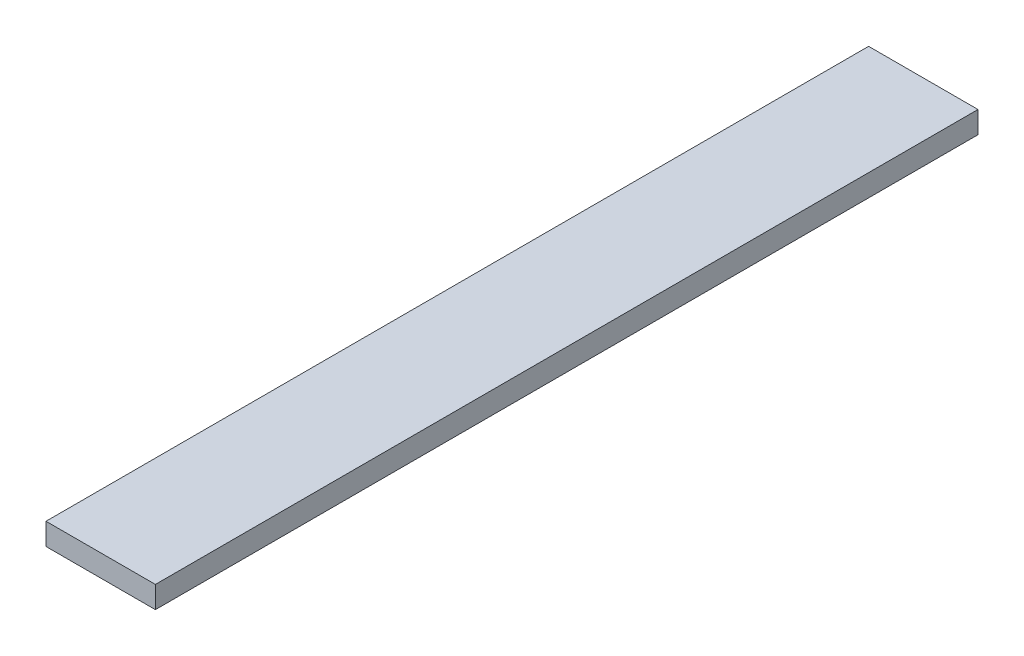
ISO-10303-21;
HEADER;
FILE_DESCRIPTION(('STEP AP214'),'2;1');
FILE_NAME('part.step','',(''),(''),'','','');
FILE_SCHEMA(('AUTOMOTIVE_DESIGN { 1 0 10303 214 1 1 1 1 }'));
ENDSEC;
DATA;
#1=APPLICATION_CONTEXT('core data for automotive mechanical design processes');
#2=APPLICATION_PROTOCOL_DEFINITION('international standard','automotive_design',2000,#1);
#3=PRODUCT_CONTEXT('',#1,'mechanical');
#4=PRODUCT('Part','Part','',(#3));
#5=PRODUCT_RELATED_PRODUCT_CATEGORY('part','',(#4));
#6=PRODUCT_DEFINITION_FORMATION('','',#4);
#7=PRODUCT_DEFINITION_CONTEXT('part definition',#1,'design');
#8=PRODUCT_DEFINITION('design','',#6,#7);
#9=PRODUCT_DEFINITION_SHAPE('','',#8);
#10=(LENGTH_UNIT() NAMED_UNIT(*) SI_UNIT(.MILLI.,.METRE.));
#11=(NAMED_UNIT(*) PLANE_ANGLE_UNIT() SI_UNIT($,.RADIAN.));
#12=(NAMED_UNIT(*) SI_UNIT($,.STERADIAN.) SOLID_ANGLE_UNIT());
#13=UNCERTAINTY_MEASURE_WITH_UNIT(LENGTH_MEASURE(1.E-05),#10,'distance_accuracy_value','');
#14=(GEOMETRIC_REPRESENTATION_CONTEXT(3) GLOBAL_UNCERTAINTY_ASSIGNED_CONTEXT((#13)) GLOBAL_UNIT_ASSIGNED_CONTEXT((#10,
#11,#12)) REPRESENTATION_CONTEXT('',''));
#15=CARTESIAN_POINT('',(0.,0.,0.));
#16=DIRECTION('',(0.,0.,1.));
#17=DIRECTION('',(1.,0.,0.));
#18=AXIS2_PLACEMENT_3D('',#15,#16,#17);
#19=CARTESIAN_POINT('',(0.,2.02999999999,0.));
#20=DIRECTION('',(0.,1.,0.));
#21=DIRECTION('',(0.,0.,1.));
#22=AXIS2_PLACEMENT_3D('',#19,#20,#21);
#23=PLANE('',#22);
#24=DIRECTION('',(1.,0.,0.));
#25=VECTOR('',#24,1.);
#26=CARTESIAN_POINT('',(0.,2.02999999999,0.195));
#27=LINE('',#26,#25);
#28=CARTESIAN_POINT('',(-2.125,2.02999999999,0.195));
#29=VERTEX_POINT('',#28);
#30=CARTESIAN_POINT('',(-2.375,2.02999999999,0.195));
#31=VERTEX_POINT('',#30);
#32=EDGE_CURVE('E19',#29,#31,#27,.F.);
#33=ORIENTED_EDGE('',*,*,#32,.F.);
#34=DIRECTION('',(0.,0.,1.));
#35=VECTOR('',#34,1.);
#36=CARTESIAN_POINT('',(-2.125,2.02999999999,0.195));
#37=LINE('',#36,#35);
#38=CARTESIAN_POINT('',(-2.125,2.02999999999,2.075));
#39=VERTEX_POINT('',#38);
#40=EDGE_CURVE('E68',#29,#39,#37,.T.);
#41=ORIENTED_EDGE('',*,*,#40,.T.);
#42=DIRECTION('',(-1.,0.,0.));
#43=VECTOR('',#42,1.);
#44=CARTESIAN_POINT('',(-2.375,2.02999999999,2.075));
#45=LINE('',#44,#43);
#46=CARTESIAN_POINT('',(-2.375,2.02999999999,2.075));
#47=VERTEX_POINT('',#46);
#48=EDGE_CURVE('E55',#39,#47,#45,.T.);
#49=ORIENTED_EDGE('',*,*,#48,.T.);
#50=DIRECTION('',(0.,0.,1.));
#51=VECTOR('',#50,1.);
#52=CARTESIAN_POINT('',(-2.375,2.02999999999,0.195));
#53=LINE('',#52,#51);
#54=EDGE_CURVE('E61',#47,#31,#53,.F.);
#55=ORIENTED_EDGE('',*,*,#54,.T.);
#56=EDGE_LOOP('',(#33,#41,#49,#55));
#57=FACE_BOUND('',#56,.T.);
#58=ADVANCED_FACE('F16',(#57),#23,.F.);
#59=CARTESIAN_POINT('',(-2.375,2.07999999999,0.195));
#60=DIRECTION('',(1.,0.,0.));
#61=DIRECTION('',(0.,1.,0.));
#62=AXIS2_PLACEMENT_3D('',#59,#60,#61);
#63=PLANE('',#62);
#64=DIRECTION('',(0.,1.,0.));
#65=VECTOR('',#64,1.);
#66=CARTESIAN_POINT('',(-2.375,2.07999999999,2.075));
#67=LINE('',#66,#65);
#68=CARTESIAN_POINT('',(-2.375,2.07999999999,2.075));
#69=VERTEX_POINT('',#68);
#70=EDGE_CURVE('E63',#47,#69,#67,.T.);
#71=ORIENTED_EDGE('',*,*,#70,.T.);
#72=DIRECTION('',(0.,0.,1.));
#73=VECTOR('',#72,1.);
#74=CARTESIAN_POINT('',(-2.375,2.07999999999,0.));
#75=LINE('',#74,#73);
#76=CARTESIAN_POINT('',(-2.375,2.07999999999,0.195));
#77=VERTEX_POINT('',#76);
#78=EDGE_CURVE('E82',#77,#69,#75,.T.);
#79=ORIENTED_EDGE('',*,*,#78,.F.);
#80=DIRECTION('',(0.,1.,0.));
#81=VECTOR('',#80,1.);
#82=CARTESIAN_POINT('',(-2.375,2.07999999999,0.195));
#83=LINE('',#82,#81);
#84=EDGE_CURVE('E66',#77,#31,#83,.F.);
#85=ORIENTED_EDGE('',*,*,#84,.T.);
#86=ORIENTED_EDGE('',*,*,#54,.F.);
#87=EDGE_LOOP('',(#71,#79,#85,#86));
#88=FACE_BOUND('',#87,.T.);
#89=ADVANCED_FACE('F62',(#88),#63,.F.);
#90=CARTESIAN_POINT('',(-2.375,2.07999999999,2.075));
#91=DIRECTION('',(0.,0.,-1.));
#92=DIRECTION('',(-1.,0.,0.));
#93=AXIS2_PLACEMENT_3D('',#90,#91,#92);
#94=PLANE('',#93);
#95=DIRECTION('',(0.,-1.,0.));
#96=VECTOR('',#95,1.);
#97=CARTESIAN_POINT('',(-2.125,2.07999999999,2.075));
#98=LINE('',#97,#96);
#99=CARTESIAN_POINT('',(-2.125,2.07999999999,2.075));
#100=VERTEX_POINT('',#99);
#101=EDGE_CURVE('E70',#39,#100,#98,.F.);
#102=ORIENTED_EDGE('',*,*,#101,.T.);
#103=DIRECTION('',(1.,0.,0.));
#104=VECTOR('',#103,1.);
#105=CARTESIAN_POINT('',(0.,2.07999999999,2.075));
#106=LINE('',#105,#104);
#107=EDGE_CURVE('E74',#69,#100,#106,.T.);
#108=ORIENTED_EDGE('',*,*,#107,.F.);
#109=ORIENTED_EDGE('',*,*,#70,.F.);
#110=ORIENTED_EDGE('',*,*,#48,.F.);
#111=EDGE_LOOP('',(#102,#108,#109,#110));
#112=FACE_BOUND('',#111,.T.);
#113=ADVANCED_FACE('F72',(#112),#94,.F.);
#114=CARTESIAN_POINT('',(-2.125,2.07999999999,0.195));
#115=DIRECTION('',(-1.,0.,0.));
#116=DIRECTION('',(0.,-1.,0.));
#117=AXIS2_PLACEMENT_3D('',#114,#115,#116);
#118=PLANE('',#117);
#119=DIRECTION('',(0.,1.,0.));
#120=VECTOR('',#119,1.);
#121=CARTESIAN_POINT('',(-2.125,2.07999999999,0.195));
#122=LINE('',#121,#120);
#123=CARTESIAN_POINT('',(-2.125,2.07999999999,0.195));
#124=VERTEX_POINT('',#123);
#125=EDGE_CURVE('E34',#29,#124,#122,.T.);
#126=ORIENTED_EDGE('',*,*,#125,.T.);
#127=DIRECTION('',(0.,0.,1.));
#128=VECTOR('',#127,1.);
#129=CARTESIAN_POINT('',(-2.125,2.07999999999,0.));
#130=LINE('',#129,#128);
#131=EDGE_CURVE('E25',#100,#124,#130,.F.);
#132=ORIENTED_EDGE('',*,*,#131,.F.);
#133=ORIENTED_EDGE('',*,*,#101,.F.);
#134=ORIENTED_EDGE('',*,*,#40,.F.);
#135=EDGE_LOOP('',(#126,#132,#133,#134));
#136=FACE_BOUND('',#135,.T.);
#137=ADVANCED_FACE('F88',(#136),#118,.F.);
#138=CARTESIAN_POINT('',(-2.375,2.07999999999,0.195));
#139=DIRECTION('',(0.,0.,1.));
#140=DIRECTION('',(1.,0.,0.));
#141=AXIS2_PLACEMENT_3D('',#138,#139,#140);
#142=PLANE('',#141);
#143=ORIENTED_EDGE('',*,*,#84,.F.);
#144=DIRECTION('',(1.,0.,0.));
#145=VECTOR('',#144,1.);
#146=CARTESIAN_POINT('',(0.,2.07999999999,0.195));
#147=LINE('',#146,#145);
#148=EDGE_CURVE('E11',#124,#77,#147,.F.);
#149=ORIENTED_EDGE('',*,*,#148,.F.);
#150=ORIENTED_EDGE('',*,*,#125,.F.);
#151=ORIENTED_EDGE('',*,*,#32,.T.);
#152=EDGE_LOOP('',(#143,#149,#150,#151));
#153=FACE_BOUND('',#152,.T.);
#154=ADVANCED_FACE('F90',(#153),#142,.F.);
#155=CARTESIAN_POINT('',(0.,2.07999999999,0.));
#156=DIRECTION('',(0.,1.,0.));
#157=DIRECTION('',(0.,0.,1.));
#158=AXIS2_PLACEMENT_3D('',#155,#156,#157);
#159=PLANE('',#158);
#160=ORIENTED_EDGE('',*,*,#131,.T.);
#161=ORIENTED_EDGE('',*,*,#148,.T.);
#162=ORIENTED_EDGE('',*,*,#78,.T.);
#163=ORIENTED_EDGE('',*,*,#107,.T.);
#164=EDGE_LOOP('',(#160,#161,#162,#163));
#165=FACE_BOUND('',#164,.T.);
#166=ADVANCED_FACE('F87',(#165),#159,.T.);
#167=CLOSED_SHELL('',(#58,#89,#113,#137,#154,#166));
#168=MANIFOLD_SOLID_BREP('B1',#167);
#169=ADVANCED_BREP_SHAPE_REPRESENTATION('',(#18,#168),#14);
#170=SHAPE_DEFINITION_REPRESENTATION(#9,#169);
ENDSEC;
END-ISO-10303-21;
